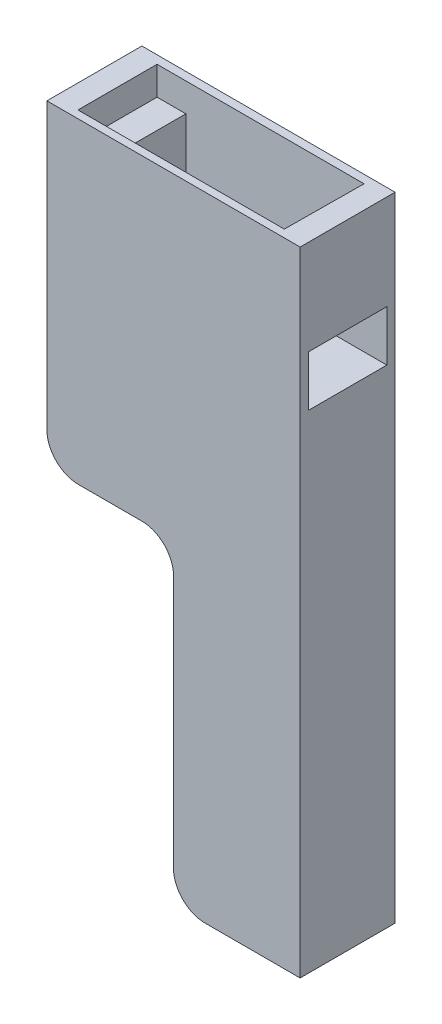
ISO-10303-21;
HEADER;
FILE_DESCRIPTION(('STEP AP214'),'2;1');
FILE_NAME('part.step','',(''),(''),'','','');
FILE_SCHEMA(('AUTOMOTIVE_DESIGN { 1 0 10303 214 1 1 1 1 }'));
ENDSEC;
DATA;
#1=APPLICATION_CONTEXT('core data for automotive mechanical design processes');
#2=APPLICATION_PROTOCOL_DEFINITION('international standard','automotive_design',2000,#1);
#3=PRODUCT_CONTEXT('',#1,'mechanical');
#4=PRODUCT('Part','Part','',(#3));
#5=PRODUCT_RELATED_PRODUCT_CATEGORY('part','',(#4));
#6=PRODUCT_DEFINITION_FORMATION('','',#4);
#7=PRODUCT_DEFINITION_CONTEXT('part definition',#1,'design');
#8=PRODUCT_DEFINITION('design','',#6,#7);
#9=PRODUCT_DEFINITION_SHAPE('','',#8);
#10=(LENGTH_UNIT() NAMED_UNIT(*) SI_UNIT(.MILLI.,.METRE.));
#11=(NAMED_UNIT(*) PLANE_ANGLE_UNIT() SI_UNIT($,.RADIAN.));
#12=(NAMED_UNIT(*) SI_UNIT($,.STERADIAN.) SOLID_ANGLE_UNIT());
#13=UNCERTAINTY_MEASURE_WITH_UNIT(LENGTH_MEASURE(1.E-05),#10,'distance_accuracy_value','');
#14=(GEOMETRIC_REPRESENTATION_CONTEXT(3) GLOBAL_UNCERTAINTY_ASSIGNED_CONTEXT((#13)) GLOBAL_UNIT_ASSIGNED_CONTEXT((#10,
#11,#12)) REPRESENTATION_CONTEXT('',''));
#15=CARTESIAN_POINT('',(0.,0.,0.));
#16=DIRECTION('',(0.,0.,1.));
#17=DIRECTION('',(1.,0.,0.));
#18=AXIS2_PLACEMENT_3D('',#15,#16,#17);
#19=CARTESIAN_POINT('',(0.,45.5,0.));
#20=DIRECTION('',(0.,1.,0.));
#21=DIRECTION('',(0.,0.,1.));
#22=AXIS2_PLACEMENT_3D('',#19,#20,#21);
#23=PLANE('',#22);
#24=DIRECTION('',(-1.,0.,0.));
#25=VECTOR('',#24,1.);
#26=CARTESIAN_POINT('',(16.4,45.5,-6.20000000000001));
#27=LINE('',#26,#25);
#28=CARTESIAN_POINT('',(16.4,45.5,-6.20000000000001));
#29=VERTEX_POINT('',#28);
#30=CARTESIAN_POINT('',(13.75,45.5,-6.20000000000001));
#31=VERTEX_POINT('',#30);
#32=EDGE_CURVE('E267',#29,#31,#27,.T.);
#33=ORIENTED_EDGE('',*,*,#32,.T.);
#34=DIRECTION('',(0.,0.,1.));
#35=VECTOR('',#34,1.);
#36=CARTESIAN_POINT('',(13.75,45.5,0.));
#37=LINE('',#36,#35);
#38=CARTESIAN_POINT('',(13.75,45.5,6.29999999999999));
#39=VERTEX_POINT('',#38);
#40=EDGE_CURVE('E198',#31,#39,#37,.T.);
#41=ORIENTED_EDGE('',*,*,#40,.T.);
#42=DIRECTION('',(1.,0.,0.));
#43=VECTOR('',#42,1.);
#44=CARTESIAN_POINT('',(16.3,45.5,6.29999999999999));
#45=LINE('',#44,#43);
#46=CARTESIAN_POINT('',(16.3,45.5,6.29999999999999));
#47=VERTEX_POINT('',#46);
#48=EDGE_CURVE('E273',#39,#47,#45,.T.);
#49=ORIENTED_EDGE('',*,*,#48,.T.);
#50=DIRECTION('',(0.00799974401228758,0.,-0.999968001535918));
#51=VECTOR('',#50,1.);
#52=CARTESIAN_POINT('',(16.3,45.5,6.29999999999999));
#53=LINE('',#52,#51);
#54=EDGE_CURVE('E262',#47,#29,#53,.T.);
#55=ORIENTED_EDGE('',*,*,#54,.T.);
#56=EDGE_LOOP('',(#33,#41,#49,#55));
#57=FACE_BOUND('',#56,.T.);
#58=ADVANCED_FACE('F39',(#57),#23,.T.);
#59=CARTESIAN_POINT('',(20.,35.,-6.2));
#60=DIRECTION('',(0.,1.,0.));
#61=DIRECTION('',(0.,0.,1.));
#62=AXIS2_PLACEMENT_3D('',#59,#60,#61);
#63=PLANE('',#62);
#64=DIRECTION('',(0.,0.,1.));
#65=VECTOR('',#64,1.);
#66=CARTESIAN_POINT('',(13.75,35.,-6.2));
#67=LINE('',#66,#65);
#68=CARTESIAN_POINT('',(13.75,35.,-6.2));
#69=VERTEX_POINT('',#68);
#70=CARTESIAN_POINT('',(13.75,35.,6.2));
#71=VERTEX_POINT('',#70);
#72=EDGE_CURVE('E47',#69,#71,#67,.T.);
#73=ORIENTED_EDGE('',*,*,#72,.F.);
#74=DIRECTION('',(-1.,0.,0.));
#75=VECTOR('',#74,1.);
#76=CARTESIAN_POINT('',(20.,35.,-6.2));
#77=LINE('',#76,#75);
#78=CARTESIAN_POINT('',(20.,35.,-6.2));
#79=VERTEX_POINT('',#78);
#80=EDGE_CURVE('E238',#79,#69,#77,.T.);
#81=ORIENTED_EDGE('',*,*,#80,.F.);
#82=DIRECTION('',(0.,0.,-1.));
#83=VECTOR('',#82,1.);
#84=CARTESIAN_POINT('',(20.,35.,-6.2));
#85=LINE('',#84,#83);
#86=CARTESIAN_POINT('',(20.,35.,6.2));
#87=VERTEX_POINT('',#86);
#88=EDGE_CURVE('E234',#87,#79,#85,.T.);
#89=ORIENTED_EDGE('',*,*,#88,.F.);
#90=DIRECTION('',(-1.,0.,0.));
#91=VECTOR('',#90,1.);
#92=CARTESIAN_POINT('',(20.,35.,6.2));
#93=LINE('',#92,#91);
#94=EDGE_CURVE('E237',#87,#71,#93,.T.);
#95=ORIENTED_EDGE('',*,*,#94,.T.);
#96=EDGE_LOOP('',(#73,#81,#89,#95));
#97=FACE_BOUND('',#96,.T.);
#98=ADVANCED_FACE('F365',(#97),#63,.F.);
#99=CARTESIAN_POINT('',(-20.,50.,7.5));
#100=DIRECTION('',(1.,0.,0.));
#101=DIRECTION('',(0.,0.,-1.));
#102=AXIS2_PLACEMENT_3D('',#99,#100,#101);
#103=PLANE('',#102);
#104=DIRECTION('',(0.,-1.,0.));
#105=VECTOR('',#104,1.);
#106=CARTESIAN_POINT('',(-20.,50.,-7.5));
#107=LINE('',#106,#105);
#108=CARTESIAN_POINT('',(-20.,50.,-7.5));
#109=VERTEX_POINT('',#108);
#110=CARTESIAN_POINT('',(-20.,5.,-7.5));
#111=VERTEX_POINT('',#110);
#112=EDGE_CURVE('E314',#109,#111,#107,.T.);
#113=ORIENTED_EDGE('',*,*,#112,.T.);
#114=DIRECTION('',(0.,0.,1.));
#115=VECTOR('',#114,1.);
#116=CARTESIAN_POINT('',(-20.,5.,7.5));
#117=LINE('',#116,#115);
#118=CARTESIAN_POINT('',(-20.,5.,7.5));
#119=VERTEX_POINT('',#118);
#120=EDGE_CURVE('E339',#111,#119,#117,.T.);
#121=ORIENTED_EDGE('',*,*,#120,.T.);
#122=DIRECTION('',(0.,-1.,0.));
#123=VECTOR('',#122,1.);
#124=CARTESIAN_POINT('',(-20.,50.,7.5));
#125=LINE('',#124,#123);
#126=CARTESIAN_POINT('',(-20.,50.,7.5));
#127=VERTEX_POINT('',#126);
#128=EDGE_CURVE('E328',#127,#119,#125,.T.);
#129=ORIENTED_EDGE('',*,*,#128,.F.);
#130=DIRECTION('',(0.,0.,1.));
#131=VECTOR('',#130,1.);
#132=CARTESIAN_POINT('',(-20.,50.,7.5));
#133=LINE('',#132,#131);
#134=EDGE_CURVE('E304',#109,#127,#133,.T.);
#135=ORIENTED_EDGE('',*,*,#134,.F.);
#136=EDGE_LOOP('',(#113,#121,#129,#135));
#137=FACE_BOUND('',#136,.T.);
#138=ADVANCED_FACE('F404',(#137),#103,.F.);
#139=CARTESIAN_POINT('',(20.,50.,7.5));
#140=DIRECTION('',(0.,0.,-1.));
#141=DIRECTION('',(-1.,0.,0.));
#142=AXIS2_PLACEMENT_3D('',#139,#140,#141);
#143=PLANE('',#142);
#144=DIRECTION('',(0.,1.,0.));
#145=VECTOR('',#144,1.);
#146=CARTESIAN_POINT('',(0.,-50.,7.5));
#147=LINE('',#146,#145);
#148=CARTESIAN_POINT('',(0.,-45.,7.5));
#149=VERTEX_POINT('',#148);
#150=CARTESIAN_POINT('',(0.,-5.,7.5));
#151=VERTEX_POINT('',#150);
#152=EDGE_CURVE('E287',#149,#151,#147,.T.);
#153=ORIENTED_EDGE('',*,*,#152,.F.);
#154=CARTESIAN_POINT('',(5.,-45.,7.5));
#155=DIRECTION('',(0.,0.,-1.));
#156=DIRECTION('',(-1.,0.,0.));
#157=AXIS2_PLACEMENT_3D('',#154,#155,#156);
#158=CIRCLE('',#157,5.);
#159=CARTESIAN_POINT('',(5.,-50.,7.5));
#160=VERTEX_POINT('',#159);
#161=EDGE_CURVE('E354',#149,#160,#158,.F.);
#162=ORIENTED_EDGE('',*,*,#161,.T.);
#163=DIRECTION('',(1.,0.,0.));
#164=VECTOR('',#163,1.);
#165=CARTESIAN_POINT('',(20.,-50.,7.5));
#166=LINE('',#165,#164);
#167=CARTESIAN_POINT('',(20.,-50.,7.5));
#168=VERTEX_POINT('',#167);
#169=EDGE_CURVE('E300',#160,#168,#166,.T.);
#170=ORIENTED_EDGE('',*,*,#169,.T.);
#171=DIRECTION('',(0.,-1.,0.));
#172=VECTOR('',#171,1.);
#173=CARTESIAN_POINT('',(20.,50.,7.5));
#174=LINE('',#173,#172);
#175=CARTESIAN_POINT('',(20.,50.,7.5));
#176=VERTEX_POINT('',#175);
#177=EDGE_CURVE('E325',#176,#168,#174,.T.);
#178=ORIENTED_EDGE('',*,*,#177,.F.);
#179=DIRECTION('',(1.,0.,0.));
#180=VECTOR('',#179,1.);
#181=CARTESIAN_POINT('',(20.,50.,7.5));
#182=LINE('',#181,#180);
#183=EDGE_CURVE('E307',#127,#176,#182,.T.);
#184=ORIENTED_EDGE('',*,*,#183,.F.);
#185=ORIENTED_EDGE('',*,*,#128,.T.);
#186=CARTESIAN_POINT('',(-15.,5.,7.5));
#187=DIRECTION('',(0.,0.,-1.));
#188=DIRECTION('',(-1.,0.,0.));
#189=AXIS2_PLACEMENT_3D('',#186,#187,#188);
#190=CIRCLE('',#189,5.);
#191=CARTESIAN_POINT('',(-15.,0.,7.5));
#192=VERTEX_POINT('',#191);
#193=EDGE_CURVE('E342',#119,#192,#190,.F.);
#194=ORIENTED_EDGE('',*,*,#193,.T.);
#195=DIRECTION('',(-1.,0.,0.));
#196=VECTOR('',#195,1.);
#197=CARTESIAN_POINT('',(-20.,0.,7.5));
#198=LINE('',#197,#196);
#199=CARTESIAN_POINT('',(-5.,0.,7.5));
#200=VERTEX_POINT('',#199);
#201=EDGE_CURVE('E297',#200,#192,#198,.T.);
#202=ORIENTED_EDGE('',*,*,#201,.F.);
#203=CARTESIAN_POINT('',(-5.,-5.,7.5));
#204=DIRECTION('',(0.,0.,-1.));
#205=DIRECTION('',(-1.,0.,0.));
#206=AXIS2_PLACEMENT_3D('',#203,#204,#205);
#207=CIRCLE('',#206,5.);
#208=EDGE_CURVE('E346',#200,#151,#207,.T.);
#209=ORIENTED_EDGE('',*,*,#208,.T.);
#210=EDGE_LOOP('',(#153,#162,#170,#178,#184,#185,#194,#202,#209));
#211=FACE_BOUND('',#210,.T.);
#212=ADVANCED_FACE('F444',(#211),#143,.F.);
#213=CARTESIAN_POINT('',(20.,50.,7.5));
#214=DIRECTION('',(-1.,0.,0.));
#215=DIRECTION('',(0.,0.,1.));
#216=AXIS2_PLACEMENT_3D('',#213,#214,#215);
#217=PLANE('',#216);
#218=ORIENTED_EDGE('',*,*,#88,.T.);
#219=DIRECTION('',(0.,-1.,0.));
#220=VECTOR('',#219,1.);
#221=CARTESIAN_POINT('',(20.,27.,-6.2));
#222=LINE('',#221,#220);
#223=CARTESIAN_POINT('',(20.,27.,-6.2));
#224=VERTEX_POINT('',#223);
#225=EDGE_CURVE('E225',#79,#224,#222,.T.);
#226=ORIENTED_EDGE('',*,*,#225,.T.);
#227=DIRECTION('',(0.,0.,1.));
#228=VECTOR('',#227,1.);
#229=CARTESIAN_POINT('',(20.,27.,-6.2));
#230=LINE('',#229,#228);
#231=CARTESIAN_POINT('',(20.,27.,6.2));
#232=VERTEX_POINT('',#231);
#233=EDGE_CURVE('E228',#224,#232,#230,.T.);
#234=ORIENTED_EDGE('',*,*,#233,.T.);
#235=DIRECTION('',(0.,1.,0.));
#236=VECTOR('',#235,1.);
#237=CARTESIAN_POINT('',(20.,27.,6.2));
#238=LINE('',#237,#236);
#239=EDGE_CURVE('E231',#232,#87,#238,.T.);
#240=ORIENTED_EDGE('',*,*,#239,.T.);
#241=EDGE_LOOP('',(#218,#226,#234,#240));
#242=FACE_BOUND('',#241,.T.);
#243=DIRECTION('',(0.,0.,-1.));
#244=VECTOR('',#243,1.);
#245=CARTESIAN_POINT('',(20.,-50.,7.5));
#246=LINE('',#245,#244);
#247=CARTESIAN_POINT('',(20.,-50.,-7.5));
#248=VERTEX_POINT('',#247);
#249=EDGE_CURVE('E316',#168,#248,#246,.T.);
#250=ORIENTED_EDGE('',*,*,#249,.T.);
#251=DIRECTION('',(0.,-1.,0.));
#252=VECTOR('',#251,1.);
#253=CARTESIAN_POINT('',(20.,50.,-7.5));
#254=LINE('',#253,#252);
#255=CARTESIAN_POINT('',(20.,50.,-7.5));
#256=VERTEX_POINT('',#255);
#257=EDGE_CURVE('E322',#256,#248,#254,.T.);
#258=ORIENTED_EDGE('',*,*,#257,.F.);
#259=DIRECTION('',(0.,0.,-1.));
#260=VECTOR('',#259,1.);
#261=CARTESIAN_POINT('',(20.,50.,7.5));
#262=LINE('',#261,#260);
#263=EDGE_CURVE('E310',#176,#256,#262,.T.);
#264=ORIENTED_EDGE('',*,*,#263,.F.);
#265=ORIENTED_EDGE('',*,*,#177,.T.);
#266=EDGE_LOOP('',(#250,#258,#264,#265));
#267=FACE_BOUND('',#266,.T.);
#268=ADVANCED_FACE('F368',(#242,#267),#217,.F.);
#269=CARTESIAN_POINT('',(20.,50.,-7.5));
#270=DIRECTION('',(0.,0.,1.));
#271=DIRECTION('',(1.,0.,0.));
#272=AXIS2_PLACEMENT_3D('',#269,#270,#271);
#273=PLANE('',#272);
#274=DIRECTION('',(-1.,0.,0.));
#275=VECTOR('',#274,1.);
#276=CARTESIAN_POINT('',(20.,-50.,-7.5));
#277=LINE('',#276,#275);
#278=CARTESIAN_POINT('',(5.,-50.,-7.5));
#279=VERTEX_POINT('',#278);
#280=EDGE_CURVE('E308',#248,#279,#277,.T.);
#281=ORIENTED_EDGE('',*,*,#280,.T.);
#282=CARTESIAN_POINT('',(5.,-45.,-7.5));
#283=DIRECTION('',(0.,0.,1.));
#284=DIRECTION('',(1.,0.,0.));
#285=AXIS2_PLACEMENT_3D('',#282,#283,#284);
#286=CIRCLE('',#285,5.);
#287=CARTESIAN_POINT('',(0.,-45.,-7.5));
#288=VERTEX_POINT('',#287);
#289=EDGE_CURVE('E358',#279,#288,#286,.F.);
#290=ORIENTED_EDGE('',*,*,#289,.T.);
#291=DIRECTION('',(0.,1.,0.));
#292=VECTOR('',#291,1.);
#293=CARTESIAN_POINT('',(0.,-50.,-7.5));
#294=LINE('',#293,#292);
#295=CARTESIAN_POINT('',(0.,-5.,-7.5));
#296=VERTEX_POINT('',#295);
#297=EDGE_CURVE('E294',#288,#296,#294,.T.);
#298=ORIENTED_EDGE('',*,*,#297,.T.);
#299=CARTESIAN_POINT('',(-5.,-5.,-7.5));
#300=DIRECTION('',(0.,0.,1.));
#301=DIRECTION('',(1.,0.,0.));
#302=AXIS2_PLACEMENT_3D('',#299,#300,#301);
#303=CIRCLE('',#302,5.);
#304=CARTESIAN_POINT('',(-5.,0.,-7.5));
#305=VERTEX_POINT('',#304);
#306=EDGE_CURVE('E349',#296,#305,#303,.T.);
#307=ORIENTED_EDGE('',*,*,#306,.T.);
#308=DIRECTION('',(-1.,0.,0.));
#309=VECTOR('',#308,1.);
#310=CARTESIAN_POINT('',(-20.,0.,-7.5));
#311=LINE('',#310,#309);
#312=CARTESIAN_POINT('',(-15.,0.,-7.5));
#313=VERTEX_POINT('',#312);
#314=EDGE_CURVE('E296',#305,#313,#311,.T.);
#315=ORIENTED_EDGE('',*,*,#314,.T.);
#316=CARTESIAN_POINT('',(-15.,5.,-7.5));
#317=DIRECTION('',(0.,0.,1.));
#318=DIRECTION('',(1.,0.,0.));
#319=AXIS2_PLACEMENT_3D('',#316,#317,#318);
#320=CIRCLE('',#319,5.);
#321=EDGE_CURVE('E344',#313,#111,#320,.F.);
#322=ORIENTED_EDGE('',*,*,#321,.T.);
#323=ORIENTED_EDGE('',*,*,#112,.F.);
#324=DIRECTION('',(-1.,0.,0.));
#325=VECTOR('',#324,1.);
#326=CARTESIAN_POINT('',(20.,50.,-7.5));
#327=LINE('',#326,#325);
#328=EDGE_CURVE('E312',#256,#109,#327,.T.);
#329=ORIENTED_EDGE('',*,*,#328,.F.);
#330=ORIENTED_EDGE('',*,*,#257,.T.);
#331=EDGE_LOOP('',(#281,#290,#298,#307,#315,#322,#323,#329,#330));
#332=FACE_BOUND('',#331,.T.);
#333=ADVANCED_FACE('F435',(#332),#273,.F.);
#334=CARTESIAN_POINT('',(0.,50.,0.));
#335=DIRECTION('',(0.,1.,0.));
#336=DIRECTION('',(0.,0.,1.));
#337=AXIS2_PLACEMENT_3D('',#334,#335,#336);
#338=PLANE('',#337);
#339=DIRECTION('',(0.00799974401228758,0.,-0.999968001535918));
#340=VECTOR('',#339,1.);
#341=CARTESIAN_POINT('',(16.3,50.,6.29999999999999));
#342=LINE('',#341,#340);
#343=CARTESIAN_POINT('',(16.3,50.,6.29999999999999));
#344=VERTEX_POINT('',#343);
#345=CARTESIAN_POINT('',(16.4,50.,-6.20000000000001));
#346=VERTEX_POINT('',#345);
#347=EDGE_CURVE('E258',#344,#346,#342,.T.);
#348=ORIENTED_EDGE('',*,*,#347,.F.);
#349=DIRECTION('',(1.,0.,0.));
#350=VECTOR('',#349,1.);
#351=CARTESIAN_POINT('',(16.3,50.,6.29999999999999));
#352=LINE('',#351,#350);
#353=CARTESIAN_POINT('',(-16.3,50.,6.3));
#354=VERTEX_POINT('',#353);
#355=EDGE_CURVE('E266',#354,#344,#352,.T.);
#356=ORIENTED_EDGE('',*,*,#355,.F.);
#357=DIRECTION('',(0.,0.,1.));
#358=VECTOR('',#357,1.);
#359=CARTESIAN_POINT('',(-16.3,50.,6.3));
#360=LINE('',#359,#358);
#361=CARTESIAN_POINT('',(-16.3,50.,-6.2));
#362=VERTEX_POINT('',#361);
#363=EDGE_CURVE('E281',#362,#354,#360,.T.);
#364=ORIENTED_EDGE('',*,*,#363,.F.);
#365=DIRECTION('',(-1.,0.,0.));
#366=VECTOR('',#365,1.);
#367=CARTESIAN_POINT('',(16.4,50.,-6.20000000000001));
#368=LINE('',#367,#366);
#369=EDGE_CURVE('E278',#346,#362,#368,.T.);
#370=ORIENTED_EDGE('',*,*,#369,.F.);
#371=EDGE_LOOP('',(#348,#356,#364,#370));
#372=FACE_BOUND('',#371,.T.);
#373=ORIENTED_EDGE('',*,*,#134,.T.);
#374=ORIENTED_EDGE('',*,*,#183,.T.);
#375=ORIENTED_EDGE('',*,*,#263,.T.);
#376=ORIENTED_EDGE('',*,*,#328,.T.);
#377=EDGE_LOOP('',(#373,#374,#375,#376));
#378=FACE_BOUND('',#377,.T.);
#379=ADVANCED_FACE('F389',(#372,#378),#338,.T.);
#380=CARTESIAN_POINT('',(0.,-50.,0.));
#381=DIRECTION('',(0.,1.,0.));
#382=DIRECTION('',(0.,0.,1.));
#383=AXIS2_PLACEMENT_3D('',#380,#381,#382);
#384=PLANE('',#383);
#385=ORIENTED_EDGE('',*,*,#169,.F.);
#386=DIRECTION('',(0.,0.,1.));
#387=VECTOR('',#386,1.);
#388=CARTESIAN_POINT('',(5.,-50.,0.));
#389=LINE('',#388,#387);
#390=EDGE_CURVE('E356',#160,#279,#389,.F.);
#391=ORIENTED_EDGE('',*,*,#390,.T.);
#392=ORIENTED_EDGE('',*,*,#280,.F.);
#393=ORIENTED_EDGE('',*,*,#249,.F.);
#394=EDGE_LOOP('',(#385,#391,#392,#393));
#395=FACE_BOUND('',#394,.T.);
#396=ADVANCED_FACE('F427',(#395),#384,.F.);
#397=CARTESIAN_POINT('',(-20.,0.,-7.5));
#398=DIRECTION('',(0.,1.,0.));
#399=DIRECTION('',(0.,0.,1.));
#400=AXIS2_PLACEMENT_3D('',#397,#398,#399);
#401=PLANE('',#400);
#402=ORIENTED_EDGE('',*,*,#314,.F.);
#403=DIRECTION('',(0.,0.,1.));
#404=VECTOR('',#403,1.);
#405=CARTESIAN_POINT('',(-5.,0.,7.5));
#406=LINE('',#405,#404);
#407=EDGE_CURVE('E333',#305,#200,#406,.T.);
#408=ORIENTED_EDGE('',*,*,#407,.T.);
#409=ORIENTED_EDGE('',*,*,#201,.T.);
#410=DIRECTION('',(0.,0.,1.));
#411=VECTOR('',#410,1.);
#412=CARTESIAN_POINT('',(-15.,0.,-7.5));
#413=LINE('',#412,#411);
#414=EDGE_CURVE('E331',#192,#313,#413,.F.);
#415=ORIENTED_EDGE('',*,*,#414,.T.);
#416=EDGE_LOOP('',(#402,#408,#409,#415));
#417=FACE_BOUND('',#416,.T.);
#418=ADVANCED_FACE('F423',(#417),#401,.F.);
#419=CARTESIAN_POINT('',(0.,-50.,-7.5));
#420=DIRECTION('',(1.,0.,0.));
#421=DIRECTION('',(0.,0.,-1.));
#422=AXIS2_PLACEMENT_3D('',#419,#420,#421);
#423=PLANE('',#422);
#424=ORIENTED_EDGE('',*,*,#297,.F.);
#425=DIRECTION('',(0.,0.,1.));
#426=VECTOR('',#425,1.);
#427=CARTESIAN_POINT('',(0.,-45.,-7.5));
#428=LINE('',#427,#426);
#429=EDGE_CURVE('E351',#288,#149,#428,.T.);
#430=ORIENTED_EDGE('',*,*,#429,.T.);
#431=ORIENTED_EDGE('',*,*,#152,.T.);
#432=DIRECTION('',(0.,0.,1.));
#433=VECTOR('',#432,1.);
#434=CARTESIAN_POINT('',(0.,-5.,-7.5));
#435=LINE('',#434,#433);
#436=EDGE_CURVE('E336',#151,#296,#435,.F.);
#437=ORIENTED_EDGE('',*,*,#436,.T.);
#438=EDGE_LOOP('',(#424,#430,#431,#437));
#439=FACE_BOUND('',#438,.T.);
#440=ADVANCED_FACE('F426',(#439),#423,.F.);
#441=CARTESIAN_POINT('',(-5.,-5.,-7.5));
#442=DIRECTION('',(0.,0.,-1.));
#443=DIRECTION('',(-1.,0.,0.));
#444=AXIS2_PLACEMENT_3D('',#441,#442,#443);
#445=CYLINDRICAL_SURFACE('',#444,5.);
#446=ORIENTED_EDGE('',*,*,#306,.F.);
#447=ORIENTED_EDGE('',*,*,#436,.F.);
#448=ORIENTED_EDGE('',*,*,#208,.F.);
#449=ORIENTED_EDGE('',*,*,#407,.F.);
#450=EDGE_LOOP('',(#446,#447,#448,#449));
#451=FACE_BOUND('',#450,.T.);
#452=ADVANCED_FACE('F431',(#451),#445,.F.);
#453=CARTESIAN_POINT('',(-15.,5.,7.5));
#454=DIRECTION('',(0.,0.,1.));
#455=DIRECTION('',(1.,0.,0.));
#456=AXIS2_PLACEMENT_3D('',#453,#454,#455);
#457=CYLINDRICAL_SURFACE('',#456,5.);
#458=ORIENTED_EDGE('',*,*,#321,.F.);
#459=ORIENTED_EDGE('',*,*,#414,.F.);
#460=ORIENTED_EDGE('',*,*,#193,.F.);
#461=ORIENTED_EDGE('',*,*,#120,.F.);
#462=EDGE_LOOP('',(#458,#459,#460,#461));
#463=FACE_BOUND('',#462,.T.);
#464=ADVANCED_FACE('F452',(#463),#457,.T.);
#465=CARTESIAN_POINT('',(5.,-45.,-7.5));
#466=DIRECTION('',(0.,0.,1.));
#467=DIRECTION('',(1.,0.,0.));
#468=AXIS2_PLACEMENT_3D('',#465,#466,#467);
#469=CYLINDRICAL_SURFACE('',#468,5.);
#470=ORIENTED_EDGE('',*,*,#289,.F.);
#471=ORIENTED_EDGE('',*,*,#390,.F.);
#472=ORIENTED_EDGE('',*,*,#161,.F.);
#473=ORIENTED_EDGE('',*,*,#429,.F.);
#474=EDGE_LOOP('',(#470,#471,#472,#473));
#475=FACE_BOUND('',#474,.T.);
#476=ADVANCED_FACE('F41',(#475),#469,.T.);
#477=CARTESIAN_POINT('',(16.3,45.5,6.29999999999999));
#478=DIRECTION('',(0.999968001535918,0.,0.00799974401228758));
#479=DIRECTION('',(0.00799974401228758,0.,-0.999968001535918));
#480=AXIS2_PLACEMENT_3D('',#477,#478,#479);
#481=PLANE('',#480);
#482=ORIENTED_EDGE('',*,*,#347,.T.);
#483=DIRECTION('',(0.,1.,0.));
#484=VECTOR('',#483,1.);
#485=CARTESIAN_POINT('',(16.4,45.5,-6.20000000000001));
#486=LINE('',#485,#484);
#487=EDGE_CURVE('E276',#29,#346,#486,.T.);
#488=ORIENTED_EDGE('',*,*,#487,.F.);
#489=ORIENTED_EDGE('',*,*,#54,.F.);
#490=DIRECTION('',(0.,1.,0.));
#491=VECTOR('',#490,1.);
#492=CARTESIAN_POINT('',(16.3,45.5,6.29999999999999));
#493=LINE('',#492,#491);
#494=EDGE_CURVE('E285',#47,#344,#493,.T.);
#495=ORIENTED_EDGE('',*,*,#494,.T.);
#496=EDGE_LOOP('',(#482,#488,#489,#495));
#497=FACE_BOUND('',#496,.T.);
#498=ADVANCED_FACE('F392',(#497),#481,.F.);
#499=CARTESIAN_POINT('',(16.3,45.5,6.29999999999999));
#500=DIRECTION('',(0.,0.,1.));
#501=DIRECTION('',(1.,0.,0.));
#502=AXIS2_PLACEMENT_3D('',#499,#500,#501);
#503=PLANE('',#502);
#504=ORIENTED_EDGE('',*,*,#355,.T.);
#505=ORIENTED_EDGE('',*,*,#494,.F.);
#506=ORIENTED_EDGE('',*,*,#48,.F.);
#507=DIRECTION('',(0.,1.,0.));
#508=VECTOR('',#507,1.);
#509=CARTESIAN_POINT('',(13.75,33.5,6.29999999999999));
#510=LINE('',#509,#508);
#511=CARTESIAN_POINT('',(13.75,33.5,6.29999999999999));
#512=VERTEX_POINT('',#511);
#513=EDGE_CURVE('E208',#512,#39,#510,.T.);
#514=ORIENTED_EDGE('',*,*,#513,.F.);
#515=DIRECTION('',(1.,0.,0.));
#516=VECTOR('',#515,1.);
#517=CARTESIAN_POINT('',(0.,33.5,6.29999999999999));
#518=LINE('',#517,#516);
#519=CARTESIAN_POINT('',(11.75,33.5,6.29999999999999));
#520=VERTEX_POINT('',#519);
#521=EDGE_CURVE('E195',#520,#512,#518,.T.);
#522=ORIENTED_EDGE('',*,*,#521,.F.);
#523=DIRECTION('',(0.,1.,0.));
#524=VECTOR('',#523,1.);
#525=CARTESIAN_POINT('',(11.75,33.5,6.29999999999999));
#526=LINE('',#525,#524);
#527=CARTESIAN_POINT('',(11.75,45.5,6.29999999999999));
#528=VERTEX_POINT('',#527);
#529=EDGE_CURVE('E201',#520,#528,#526,.T.);
#530=ORIENTED_EDGE('',*,*,#529,.T.);
#531=CARTESIAN_POINT('',(-16.3,45.5,6.3));
#532=VERTEX_POINT('',#531);
#533=EDGE_CURVE('E274',#532,#528,#45,.T.);
#534=ORIENTED_EDGE('',*,*,#533,.F.);
#535=DIRECTION('',(0.,1.,0.));
#536=VECTOR('',#535,1.);
#537=CARTESIAN_POINT('',(-16.3,45.5,6.3));
#538=LINE('',#537,#536);
#539=EDGE_CURVE('E288',#532,#354,#538,.T.);
#540=ORIENTED_EDGE('',*,*,#539,.T.);
#541=EDGE_LOOP('',(#504,#505,#506,#514,#522,#530,#534,#540));
#542=FACE_BOUND('',#541,.T.);
#543=ADVANCED_FACE('F213',(#542),#503,.F.);
#544=CARTESIAN_POINT('',(-16.3,45.5,6.3));
#545=DIRECTION('',(-1.,0.,0.));
#546=DIRECTION('',(0.,0.,1.));
#547=AXIS2_PLACEMENT_3D('',#544,#545,#546);
#548=PLANE('',#547);
#549=ORIENTED_EDGE('',*,*,#363,.T.);
#550=ORIENTED_EDGE('',*,*,#539,.F.);
#551=DIRECTION('',(0.,0.,1.));
#552=VECTOR('',#551,1.);
#553=CARTESIAN_POINT('',(-16.3,45.5,6.3));
#554=LINE('',#553,#552);
#555=CARTESIAN_POINT('',(-16.3,45.5,-6.2));
#556=VERTEX_POINT('',#555);
#557=EDGE_CURVE('E270',#556,#532,#554,.T.);
#558=ORIENTED_EDGE('',*,*,#557,.F.);
#559=DIRECTION('',(0.,1.,0.));
#560=VECTOR('',#559,1.);
#561=CARTESIAN_POINT('',(-16.3,45.5,-6.2));
#562=LINE('',#561,#560);
#563=EDGE_CURVE('E290',#556,#362,#562,.T.);
#564=ORIENTED_EDGE('',*,*,#563,.T.);
#565=EDGE_LOOP('',(#549,#550,#558,#564));
#566=FACE_BOUND('',#565,.T.);
#567=ADVANCED_FACE('F385',(#566),#548,.F.);
#568=CARTESIAN_POINT('',(16.4,45.5,-6.20000000000001));
#569=DIRECTION('',(0.,0.,-1.));
#570=DIRECTION('',(-1.,0.,0.));
#571=AXIS2_PLACEMENT_3D('',#568,#569,#570);
#572=PLANE('',#571);
#573=ORIENTED_EDGE('',*,*,#80,.T.);
#574=DIRECTION('',(0.,1.,0.));
#575=VECTOR('',#574,1.);
#576=CARTESIAN_POINT('',(13.75,33.5,-6.20000000000001));
#577=LINE('',#576,#575);
#578=EDGE_CURVE('E54',#69,#31,#577,.T.);
#579=ORIENTED_EDGE('',*,*,#578,.T.);
#580=ORIENTED_EDGE('',*,*,#32,.F.);
#581=ORIENTED_EDGE('',*,*,#487,.T.);
#582=ORIENTED_EDGE('',*,*,#369,.T.);
#583=ORIENTED_EDGE('',*,*,#563,.F.);
#584=CARTESIAN_POINT('',(-11.75,45.5,-6.2));
#585=VERTEX_POINT('',#584);
#586=EDGE_CURVE('E265',#585,#556,#27,.T.);
#587=ORIENTED_EDGE('',*,*,#586,.F.);
#588=DIRECTION('',(0.,1.,0.));
#589=VECTOR('',#588,1.);
#590=CARTESIAN_POINT('',(-11.75,27.,-6.2));
#591=LINE('',#590,#589);
#592=CARTESIAN_POINT('',(-11.75,27.,-6.2));
#593=VERTEX_POINT('',#592);
#594=EDGE_CURVE('E256',#593,#585,#591,.T.);
#595=ORIENTED_EDGE('',*,*,#594,.F.);
#596=DIRECTION('',(-1.,0.,0.));
#597=VECTOR('',#596,1.);
#598=CARTESIAN_POINT('',(11.75,27.,-6.2));
#599=LINE('',#598,#597);
#600=EDGE_CURVE('E248',#224,#593,#599,.T.);
#601=ORIENTED_EDGE('',*,*,#600,.F.);
#602=ORIENTED_EDGE('',*,*,#225,.F.);
#603=EDGE_LOOP('',(#573,#579,#580,#581,#582,#583,#587,#595,#601,#602));
#604=FACE_BOUND('',#603,.T.);
#605=ADVANCED_FACE('F396',(#604),#572,.F.);
#606=DIRECTION('',(0.,0.,1.));
#607=VECTOR('',#606,1.);
#608=CARTESIAN_POINT('',(11.75,45.5,0.));
#609=LINE('',#608,#607);
#610=CARTESIAN_POINT('',(11.75,45.5,6.2));
#611=VERTEX_POINT('',#610);
#612=EDGE_CURVE('E204',#611,#528,#609,.T.);
#613=ORIENTED_EDGE('',*,*,#612,.F.);
#614=DIRECTION('',(1.,0.,0.));
#615=VECTOR('',#614,1.);
#616=CARTESIAN_POINT('',(11.75,45.5,6.2));
#617=LINE('',#616,#615);
#618=CARTESIAN_POINT('',(-11.75,45.5,6.2));
#619=VERTEX_POINT('',#618);
#620=EDGE_CURVE('E246',#619,#611,#617,.T.);
#621=ORIENTED_EDGE('',*,*,#620,.F.);
#622=DIRECTION('',(0.,0.,1.));
#623=VECTOR('',#622,1.);
#624=CARTESIAN_POINT('',(-11.75,45.5,6.2));
#625=LINE('',#624,#623);
#626=EDGE_CURVE('E241',#585,#619,#625,.T.);
#627=ORIENTED_EDGE('',*,*,#626,.F.);
#628=ORIENTED_EDGE('',*,*,#586,.T.);
#629=ORIENTED_EDGE('',*,*,#557,.T.);
#630=ORIENTED_EDGE('',*,*,#533,.T.);
#631=EDGE_LOOP('',(#613,#621,#627,#628,#629,#630));
#632=FACE_BOUND('',#631,.T.);
#633=ADVANCED_FACE('F378',(#632),#23,.T.);
#634=CARTESIAN_POINT('',(-11.75,27.,6.2));
#635=DIRECTION('',(-1.,0.,0.));
#636=DIRECTION('',(0.,0.,1.));
#637=AXIS2_PLACEMENT_3D('',#634,#635,#636);
#638=PLANE('',#637);
#639=ORIENTED_EDGE('',*,*,#626,.T.);
#640=DIRECTION('',(0.,1.,0.));
#641=VECTOR('',#640,1.);
#642=CARTESIAN_POINT('',(-11.75,27.,6.2));
#643=LINE('',#642,#641);
#644=CARTESIAN_POINT('',(-11.75,27.,6.2));
#645=VERTEX_POINT('',#644);
#646=EDGE_CURVE('E251',#645,#619,#643,.T.);
#647=ORIENTED_EDGE('',*,*,#646,.F.);
#648=DIRECTION('',(0.,0.,1.));
#649=VECTOR('',#648,1.);
#650=CARTESIAN_POINT('',(-11.75,27.,6.2));
#651=LINE('',#650,#649);
#652=EDGE_CURVE('E244',#593,#645,#651,.T.);
#653=ORIENTED_EDGE('',*,*,#652,.F.);
#654=ORIENTED_EDGE('',*,*,#594,.T.);
#655=EDGE_LOOP('',(#639,#647,#653,#654));
#656=FACE_BOUND('',#655,.T.);
#657=ADVANCED_FACE('F373',(#656),#638,.F.);
#658=CARTESIAN_POINT('',(11.75,27.,6.2));
#659=DIRECTION('',(0.,0.,1.));
#660=DIRECTION('',(1.,0.,0.));
#661=AXIS2_PLACEMENT_3D('',#658,#659,#660);
#662=PLANE('',#661);
#663=DIRECTION('',(0.,1.,0.));
#664=VECTOR('',#663,1.);
#665=CARTESIAN_POINT('',(11.75,27.,6.2));
#666=LINE('',#665,#664);
#667=CARTESIAN_POINT('',(11.75,33.5,6.2));
#668=VERTEX_POINT('',#667);
#669=EDGE_CURVE('E259',#668,#611,#666,.T.);
#670=ORIENTED_EDGE('',*,*,#669,.F.);
#671=DIRECTION('',(-1.,0.,0.));
#672=VECTOR('',#671,1.);
#673=CARTESIAN_POINT('',(11.75,33.5,6.2));
#674=LINE('',#673,#672);
#675=CARTESIAN_POINT('',(13.75,33.5,6.2));
#676=VERTEX_POINT('',#675);
#677=EDGE_CURVE('E11',#676,#668,#674,.T.);
#678=ORIENTED_EDGE('',*,*,#677,.F.);
#679=DIRECTION('',(0.,-1.,0.));
#680=VECTOR('',#679,1.);
#681=CARTESIAN_POINT('',(13.75,27.,6.2));
#682=LINE('',#681,#680);
#683=EDGE_CURVE('E222',#71,#676,#682,.T.);
#684=ORIENTED_EDGE('',*,*,#683,.F.);
#685=ORIENTED_EDGE('',*,*,#94,.F.);
#686=ORIENTED_EDGE('',*,*,#239,.F.);
#687=DIRECTION('',(1.,0.,0.));
#688=VECTOR('',#687,1.);
#689=CARTESIAN_POINT('',(11.75,27.,6.2));
#690=LINE('',#689,#688);
#691=EDGE_CURVE('E62',#645,#232,#690,.T.);
#692=ORIENTED_EDGE('',*,*,#691,.F.);
#693=ORIENTED_EDGE('',*,*,#646,.T.);
#694=ORIENTED_EDGE('',*,*,#620,.T.);
#695=EDGE_LOOP('',(#670,#678,#684,#685,#686,#692,#693,#694));
#696=FACE_BOUND('',#695,.T.);
#697=ADVANCED_FACE('F363',(#696),#662,.F.);
#698=CARTESIAN_POINT('',(0.,27.,0.));
#699=DIRECTION('',(0.,1.,0.));
#700=DIRECTION('',(0.,0.,1.));
#701=AXIS2_PLACEMENT_3D('',#698,#699,#700);
#702=PLANE('',#701);
#703=ORIENTED_EDGE('',*,*,#652,.T.);
#704=ORIENTED_EDGE('',*,*,#691,.T.);
#705=ORIENTED_EDGE('',*,*,#233,.F.);
#706=ORIENTED_EDGE('',*,*,#600,.T.);
#707=EDGE_LOOP('',(#703,#704,#705,#706));
#708=FACE_BOUND('',#707,.T.);
#709=ADVANCED_FACE('F371',(#708),#702,.T.);
#710=CARTESIAN_POINT('',(0.,33.5,0.));
#711=DIRECTION('',(0.,1.,0.));
#712=DIRECTION('',(0.,0.,1.));
#713=AXIS2_PLACEMENT_3D('',#710,#711,#712);
#714=PLANE('',#713);
#715=ORIENTED_EDGE('',*,*,#677,.T.);
#716=DIRECTION('',(0.,0.,1.));
#717=VECTOR('',#716,1.);
#718=CARTESIAN_POINT('',(11.75,33.5,0.));
#719=LINE('',#718,#717);
#720=EDGE_CURVE('E190',#668,#520,#719,.T.);
#721=ORIENTED_EDGE('',*,*,#720,.T.);
#722=ORIENTED_EDGE('',*,*,#521,.T.);
#723=DIRECTION('',(0.,0.,1.));
#724=VECTOR('',#723,1.);
#725=CARTESIAN_POINT('',(13.75,33.5,0.));
#726=LINE('',#725,#724);
#727=EDGE_CURVE('E209',#676,#512,#726,.T.);
#728=ORIENTED_EDGE('',*,*,#727,.F.);
#729=EDGE_LOOP('',(#715,#721,#722,#728));
#730=FACE_BOUND('',#729,.T.);
#731=ADVANCED_FACE('F192',(#730),#714,.T.);
#732=CARTESIAN_POINT('',(11.75,33.5,0.));
#733=DIRECTION('',(-1.,0.,0.));
#734=DIRECTION('',(0.,0.,1.));
#735=AXIS2_PLACEMENT_3D('',#732,#733,#734);
#736=PLANE('',#735);
#737=ORIENTED_EDGE('',*,*,#612,.T.);
#738=ORIENTED_EDGE('',*,*,#529,.F.);
#739=ORIENTED_EDGE('',*,*,#720,.F.);
#740=ORIENTED_EDGE('',*,*,#669,.T.);
#741=EDGE_LOOP('',(#737,#738,#739,#740));
#742=FACE_BOUND('',#741,.T.);
#743=ADVANCED_FACE('F202',(#742),#736,.F.);
#744=CARTESIAN_POINT('',(13.75,33.5,0.));
#745=DIRECTION('',(-1.,0.,0.));
#746=DIRECTION('',(0.,0.,1.));
#747=AXIS2_PLACEMENT_3D('',#744,#745,#746);
#748=PLANE('',#747);
#749=ORIENTED_EDGE('',*,*,#683,.T.);
#750=ORIENTED_EDGE('',*,*,#727,.T.);
#751=ORIENTED_EDGE('',*,*,#513,.T.);
#752=ORIENTED_EDGE('',*,*,#40,.F.);
#753=ORIENTED_EDGE('',*,*,#578,.F.);
#754=ORIENTED_EDGE('',*,*,#72,.T.);
#755=EDGE_LOOP('',(#749,#750,#751,#752,#753,#754));
#756=FACE_BOUND('',#755,.T.);
#757=ADVANCED_FACE('F360',(#756),#748,.T.);
#758=CLOSED_SHELL('',(#58,#98,#138,#212,#268,#333,#379,#396,#418,#440,#452,#464,#476,#498,#543,
#567,#605,#633,#657,#697,#709,#731,#743,#757));
#759=MANIFOLD_SOLID_BREP('B2',#758);
#760=ADVANCED_BREP_SHAPE_REPRESENTATION('',(#18,#759),#14);
#761=SHAPE_DEFINITION_REPRESENTATION(#9,#760);
ENDSEC;
END-ISO-10303-21;
